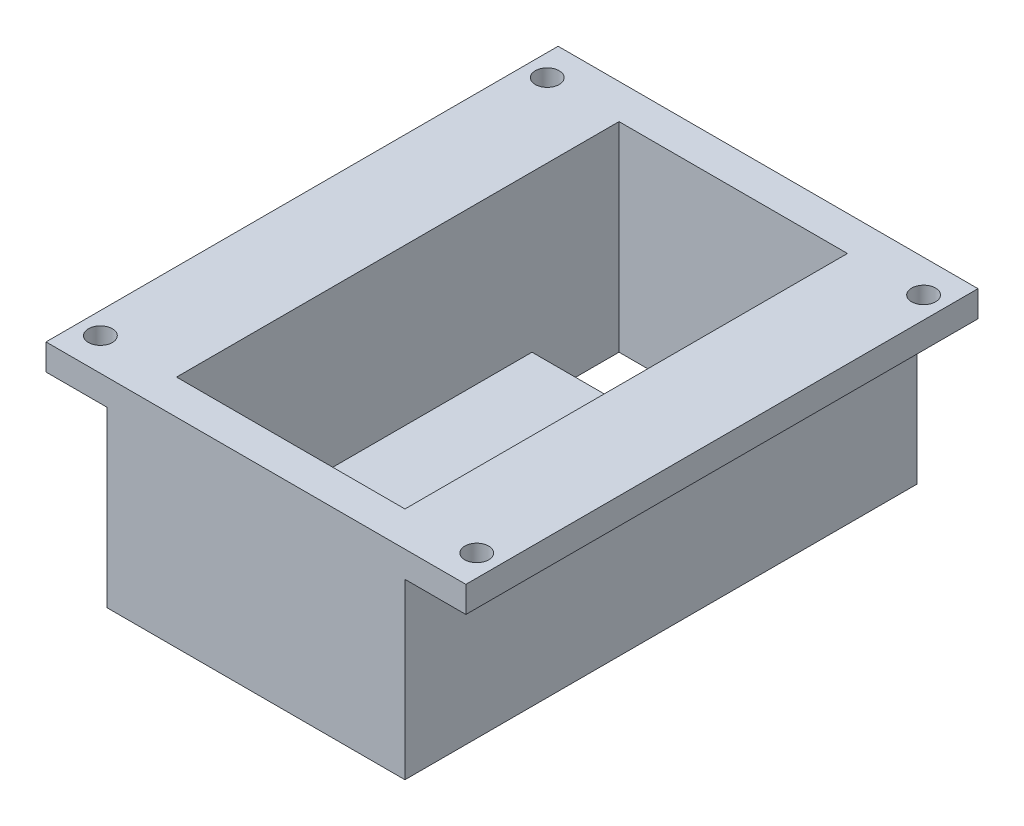
ISO-10303-21;
HEADER;
FILE_DESCRIPTION(('STEP AP214'),'2;1');
FILE_NAME('part.step','',(''),(''),'','','');
FILE_SCHEMA(('AUTOMOTIVE_DESIGN { 1 0 10303 214 1 1 1 1 }'));
ENDSEC;
DATA;
#1=APPLICATION_CONTEXT('core data for automotive mechanical design processes');
#2=APPLICATION_PROTOCOL_DEFINITION('international standard','automotive_design',2000,#1);
#3=PRODUCT_CONTEXT('',#1,'mechanical');
#4=PRODUCT('Part','Part','',(#3));
#5=PRODUCT_RELATED_PRODUCT_CATEGORY('part','',(#4));
#6=PRODUCT_DEFINITION_FORMATION('','',#4);
#7=PRODUCT_DEFINITION_CONTEXT('part definition',#1,'design');
#8=PRODUCT_DEFINITION('design','',#6,#7);
#9=PRODUCT_DEFINITION_SHAPE('','',#8);
#10=(LENGTH_UNIT() NAMED_UNIT(*) SI_UNIT(.MILLI.,.METRE.));
#11=(NAMED_UNIT(*) PLANE_ANGLE_UNIT() SI_UNIT($,.RADIAN.));
#12=(NAMED_UNIT(*) SI_UNIT($,.STERADIAN.) SOLID_ANGLE_UNIT());
#13=UNCERTAINTY_MEASURE_WITH_UNIT(LENGTH_MEASURE(1.E-05),#10,'distance_accuracy_value','');
#14=(GEOMETRIC_REPRESENTATION_CONTEXT(3) GLOBAL_UNCERTAINTY_ASSIGNED_CONTEXT((#13)) GLOBAL_UNIT_ASSIGNED_CONTEXT((#10,
#11,#12)) REPRESENTATION_CONTEXT('',''));
#15=CARTESIAN_POINT('',(0.,0.,0.));
#16=DIRECTION('',(0.,0.,1.));
#17=DIRECTION('',(1.,0.,0.));
#18=AXIS2_PLACEMENT_3D('',#15,#16,#17);
#19=CARTESIAN_POINT('',(9.8883841879781,38.0114144491201,67.8031633130832));
#20=DIRECTION('',(0.,1.,0.));
#21=DIRECTION('',(0.,0.,-1.));
#22=AXIS2_PLACEMENT_3D('',#19,#20,#21);
#23=PLANE('',#22);
#24=DIRECTION('',(-1.,0.,0.));
#25=VECTOR('',#24,1.);
#26=CARTESIAN_POINT('',(9.8883841879781,38.0114144491201,67.8031633130832));
#27=LINE('',#26,#25);
#28=CARTESIAN_POINT('',(36.1383841879781,38.0114144491201,67.8031633130832));
#29=VERTEX_POINT('',#28);
#30=CARTESIAN_POINT('',(9.8883841879781,38.0114144491201,67.8031633130832));
#31=VERTEX_POINT('',#30);
#32=EDGE_CURVE('E179',#29,#31,#27,.T.);
#33=ORIENTED_EDGE('',*,*,#32,.F.);
#34=DIRECTION('',(0.,0.,1.));
#35=VECTOR('',#34,1.);
#36=CARTESIAN_POINT('',(36.1383841879781,38.0114144491201,67.8031633130832));
#37=LINE('',#36,#35);
#38=CARTESIAN_POINT('',(36.1383841879781,38.0114144491201,26.9531633130832));
#39=VERTEX_POINT('',#38);
#40=EDGE_CURVE('E11',#39,#29,#37,.T.);
#41=ORIENTED_EDGE('',*,*,#40,.F.);
#42=DIRECTION('',(1.,0.,0.));
#43=VECTOR('',#42,1.);
#44=CARTESIAN_POINT('',(-1.11161581202189,38.0114144491201,26.9531633130832));
#45=LINE('',#44,#43);
#46=CARTESIAN_POINT('',(9.8883841879781,38.0114144491201,26.9531633130832));
#47=VERTEX_POINT('',#46);
#48=EDGE_CURVE('E202',#47,#39,#45,.T.);
#49=ORIENTED_EDGE('',*,*,#48,.F.);
#50=DIRECTION('',(0.,0.,-1.));
#51=VECTOR('',#50,1.);
#52=CARTESIAN_POINT('',(9.8883841879781,38.0114144491201,67.8031633130832));
#53=LINE('',#52,#51);
#54=EDGE_CURVE('E51',#31,#47,#53,.T.);
#55=ORIENTED_EDGE('',*,*,#54,.F.);
#56=EDGE_LOOP('',(#33,#41,#49,#55));
#57=FACE_BOUND('',#56,.T.);
#58=ADVANCED_FACE('F42',(#57),#23,.T.);
#59=CARTESIAN_POINT('',(47.1383841879781,33.0114144491201,71.8031633130832));
#60=DIRECTION('',(0.,1.,0.));
#61=DIRECTION('',(0.,0.,1.));
#62=AXIS2_PLACEMENT_3D('',#59,#60,#61);
#63=PLANE('',#62);
#64=DIRECTION('',(1.,0.,0.));
#65=VECTOR('',#64,1.);
#66=CARTESIAN_POINT('',(9.88838418797811,33.0114144491201,26.9531633130832));
#67=LINE('',#66,#65);
#68=CARTESIAN_POINT('',(9.88838418797811,33.0114144491201,26.9531633130832));
#69=VERTEX_POINT('',#68);
#70=CARTESIAN_POINT('',(36.1383841879781,33.0114144491201,26.9531633130832));
#71=VERTEX_POINT('',#70);
#72=EDGE_CURVE('E211',#69,#71,#67,.T.);
#73=ORIENTED_EDGE('',*,*,#72,.T.);
#74=DIRECTION('',(0.,0.,-1.));
#75=VECTOR('',#74,1.);
#76=CARTESIAN_POINT('',(36.1383841879781,33.0114144491201,16.9531633130832));
#77=LINE('',#76,#75);
#78=CARTESIAN_POINT('',(36.1383841879781,33.0114144491201,16.9531633130832));
#79=VERTEX_POINT('',#78);
#80=EDGE_CURVE('E222',#71,#79,#77,.T.);
#81=ORIENTED_EDGE('',*,*,#80,.T.);
#82=DIRECTION('',(-1.,0.,0.));
#83=VECTOR('',#82,1.);
#84=CARTESIAN_POINT('',(9.88838418797811,33.0114144491201,16.9531633130832));
#85=LINE('',#84,#83);
#86=CARTESIAN_POINT('',(9.88838418797811,33.0114144491201,16.9531633130832));
#87=VERTEX_POINT('',#86);
#88=EDGE_CURVE('E226',#79,#87,#85,.T.);
#89=ORIENTED_EDGE('',*,*,#88,.T.);
#90=DIRECTION('',(0.,0.,1.));
#91=VECTOR('',#90,1.);
#92=CARTESIAN_POINT('',(9.88838418797811,33.0114144491201,16.9531633130832));
#93=LINE('',#92,#91);
#94=EDGE_CURVE('E205',#87,#69,#93,.T.);
#95=ORIENTED_EDGE('',*,*,#94,.T.);
#96=EDGE_LOOP('',(#73,#81,#89,#95));
#97=FACE_BOUND('',#96,.T.);
#98=DIRECTION('',(-1.,0.,0.));
#99=VECTOR('',#98,1.);
#100=CARTESIAN_POINT('',(47.1383841879781,33.0114144491201,12.9531633130832));
#101=LINE('',#100,#99);
#102=CARTESIAN_POINT('',(40.1383841879781,33.0114144491201,12.9531633130832));
#103=VERTEX_POINT('',#102);
#104=CARTESIAN_POINT('',(5.8883841879781,33.0114144491201,12.9531633130832));
#105=VERTEX_POINT('',#104);
#106=EDGE_CURVE('E150',#103,#105,#101,.T.);
#107=ORIENTED_EDGE('',*,*,#106,.F.);
#108=DIRECTION('',(0.,0.,-1.));
#109=VECTOR('',#108,1.);
#110=CARTESIAN_POINT('',(40.1383841879781,33.0114144491201,71.8031633130832));
#111=LINE('',#110,#109);
#112=CARTESIAN_POINT('',(40.1383841879781,33.0114144491201,71.8031633130832));
#113=VERTEX_POINT('',#112);
#114=EDGE_CURVE('E159',#113,#103,#111,.T.);
#115=ORIENTED_EDGE('',*,*,#114,.F.);
#116=DIRECTION('',(1.,0.,0.));
#117=VECTOR('',#116,1.);
#118=CARTESIAN_POINT('',(47.1383841879781,33.0114144491201,71.8031633130832));
#119=LINE('',#118,#117);
#120=CARTESIAN_POINT('',(5.8883841879781,33.0114144491201,71.8031633130832));
#121=VERTEX_POINT('',#120);
#122=EDGE_CURVE('E173',#121,#113,#119,.T.);
#123=ORIENTED_EDGE('',*,*,#122,.F.);
#124=DIRECTION('',(0.,0.,1.));
#125=VECTOR('',#124,1.);
#126=CARTESIAN_POINT('',(5.8883841879781,33.0114144491201,12.9531633130832));
#127=LINE('',#126,#125);
#128=EDGE_CURVE('E167',#105,#121,#127,.T.);
#129=ORIENTED_EDGE('',*,*,#128,.F.);
#130=EDGE_LOOP('',(#107,#115,#123,#129));
#131=FACE_BOUND('',#130,.T.);
#132=ADVANCED_FACE('F170',(#97,#131),#63,.F.);
#133=CARTESIAN_POINT('',(47.1383841879781,35.0114144491201,12.9531633130832));
#134=DIRECTION('',(0.,0.,1.));
#135=DIRECTION('',(1.,0.,0.));
#136=AXIS2_PLACEMENT_3D('',#133,#134,#135);
#137=PLANE('',#136);
#138=DIRECTION('',(0.,-1.,0.));
#139=VECTOR('',#138,1.);
#140=CARTESIAN_POINT('',(40.1383841879781,55.9614144491201,12.9531633130832));
#141=LINE('',#140,#139);
#142=CARTESIAN_POINT('',(40.1383841879781,52.9614144491201,12.9531633130832));
#143=VERTEX_POINT('',#142);
#144=EDGE_CURVE('E146',#143,#103,#141,.T.);
#145=ORIENTED_EDGE('',*,*,#144,.T.);
#146=ORIENTED_EDGE('',*,*,#106,.T.);
#147=DIRECTION('',(0.,-1.,0.));
#148=VECTOR('',#147,1.);
#149=CARTESIAN_POINT('',(5.8883841879781,55.9614144491201,12.9531633130832));
#150=LINE('',#149,#148);
#151=CARTESIAN_POINT('',(5.8883841879781,52.9614144491201,12.9531633130832));
#152=VERTEX_POINT('',#151);
#153=EDGE_CURVE('E206',#152,#105,#150,.T.);
#154=ORIENTED_EDGE('',*,*,#153,.F.);
#155=DIRECTION('',(-1.,0.,0.));
#156=VECTOR('',#155,1.);
#157=CARTESIAN_POINT('',(5.8883841879781,52.9614144491201,12.9531633130832));
#158=LINE('',#157,#156);
#159=CARTESIAN_POINT('',(-1.1116158120219,52.9614144491201,12.9531633130832));
#160=VERTEX_POINT('',#159);
#161=EDGE_CURVE('E321',#152,#160,#158,.T.);
#162=ORIENTED_EDGE('',*,*,#161,.T.);
#163=DIRECTION('',(0.,1.,0.));
#164=VECTOR('',#163,1.);
#165=CARTESIAN_POINT('',(-1.1116158120219,52.9614144491201,12.9531633130832));
#166=LINE('',#165,#164);
#167=CARTESIAN_POINT('',(-1.1116158120219,55.9614144491201,12.9531633130832));
#168=VERTEX_POINT('',#167);
#169=EDGE_CURVE('E333',#160,#168,#166,.T.);
#170=ORIENTED_EDGE('',*,*,#169,.T.);
#171=DIRECTION('',(-1.,0.,0.));
#172=VECTOR('',#171,1.);
#173=CARTESIAN_POINT('',(40.1383841879781,55.9614144491201,12.9531633130832));
#174=LINE('',#173,#172);
#175=CARTESIAN_POINT('',(47.1383841879781,55.9614144491201,12.9531633130832));
#176=VERTEX_POINT('',#175);
#177=EDGE_CURVE('E267',#176,#168,#174,.T.);
#178=ORIENTED_EDGE('',*,*,#177,.F.);
#179=DIRECTION('',(0.,1.,0.));
#180=VECTOR('',#179,1.);
#181=CARTESIAN_POINT('',(47.1383841879781,52.9614144491201,12.9531633130832));
#182=LINE('',#181,#180);
#183=CARTESIAN_POINT('',(47.1383841879781,52.9614144491201,12.9531633130832));
#184=VERTEX_POINT('',#183);
#185=EDGE_CURVE('E309',#184,#176,#182,.T.);
#186=ORIENTED_EDGE('',*,*,#185,.F.);
#187=DIRECTION('',(-1.,0.,0.));
#188=VECTOR('',#187,1.);
#189=CARTESIAN_POINT('',(40.1383841879781,52.9614144491201,12.9531633130832));
#190=LINE('',#189,#188);
#191=EDGE_CURVE('E152',#184,#143,#190,.T.);
#192=ORIENTED_EDGE('',*,*,#191,.T.);
#193=EDGE_LOOP('',(#145,#146,#154,#162,#170,#178,#186,#192));
#194=FACE_BOUND('',#193,.T.);
#195=ADVANCED_FACE('F44',(#194),#137,.F.);
#196=CARTESIAN_POINT('',(47.1383841879781,35.0114144491201,71.8031633130832));
#197=DIRECTION('',(0.,0.,-1.));
#198=DIRECTION('',(-1.,0.,0.));
#199=AXIS2_PLACEMENT_3D('',#196,#197,#198);
#200=PLANE('',#199);
#201=ORIENTED_EDGE('',*,*,#122,.T.);
#202=DIRECTION('',(0.,-1.,0.));
#203=VECTOR('',#202,1.);
#204=CARTESIAN_POINT('',(40.1383841879781,55.9614144491201,71.8031633130832));
#205=LINE('',#204,#203);
#206=CARTESIAN_POINT('',(40.1383841879781,52.9614144491201,71.8031633130832));
#207=VERTEX_POINT('',#206);
#208=EDGE_CURVE('E155',#207,#113,#205,.T.);
#209=ORIENTED_EDGE('',*,*,#208,.F.);
#210=DIRECTION('',(1.,0.,0.));
#211=VECTOR('',#210,1.);
#212=CARTESIAN_POINT('',(40.1383841879781,52.9614144491201,71.8031633130832));
#213=LINE('',#212,#211);
#214=CARTESIAN_POINT('',(47.1383841879781,52.9614144491201,71.8031633130832));
#215=VERTEX_POINT('',#214);
#216=EDGE_CURVE('E304',#207,#215,#213,.T.);
#217=ORIENTED_EDGE('',*,*,#216,.T.);
#218=DIRECTION('',(0.,1.,0.));
#219=VECTOR('',#218,1.);
#220=CARTESIAN_POINT('',(47.1383841879781,52.9614144491201,71.8031633130832));
#221=LINE('',#220,#219);
#222=CARTESIAN_POINT('',(47.1383841879781,55.9614144491201,71.8031633130832));
#223=VERTEX_POINT('',#222);
#224=EDGE_CURVE('E314',#215,#223,#221,.T.);
#225=ORIENTED_EDGE('',*,*,#224,.T.);
#226=DIRECTION('',(1.,0.,0.));
#227=VECTOR('',#226,1.);
#228=CARTESIAN_POINT('',(5.8883841879781,55.9614144491201,71.8031633130832));
#229=LINE('',#228,#227);
#230=CARTESIAN_POINT('',(-1.1116158120219,55.9614144491201,71.8031633130832));
#231=VERTEX_POINT('',#230);
#232=EDGE_CURVE('E156',#231,#223,#229,.T.);
#233=ORIENTED_EDGE('',*,*,#232,.F.);
#234=DIRECTION('',(0.,1.,0.));
#235=VECTOR('',#234,1.);
#236=CARTESIAN_POINT('',(-1.1116158120219,52.9614144491201,71.8031633130832));
#237=LINE('',#236,#235);
#238=CARTESIAN_POINT('',(-1.1116158120219,52.9614144491201,71.8031633130832));
#239=VERTEX_POINT('',#238);
#240=EDGE_CURVE('E246',#239,#231,#237,.T.);
#241=ORIENTED_EDGE('',*,*,#240,.F.);
#242=DIRECTION('',(1.,0.,0.));
#243=VECTOR('',#242,1.);
#244=CARTESIAN_POINT('',(5.8883841879781,52.9614144491201,71.8031633130832));
#245=LINE('',#244,#243);
#246=CARTESIAN_POINT('',(5.8883841879781,52.9614144491201,71.8031633130832));
#247=VERTEX_POINT('',#246);
#248=EDGE_CURVE('E329',#239,#247,#245,.T.);
#249=ORIENTED_EDGE('',*,*,#248,.T.);
#250=DIRECTION('',(0.,-1.,0.));
#251=VECTOR('',#250,1.);
#252=CARTESIAN_POINT('',(5.8883841879781,55.9614144491201,71.8031633130832));
#253=LINE('',#252,#251);
#254=EDGE_CURVE('E213',#247,#121,#253,.T.);
#255=ORIENTED_EDGE('',*,*,#254,.T.);
#256=EDGE_LOOP('',(#201,#209,#217,#225,#233,#241,#249,#255));
#257=FACE_BOUND('',#256,.T.);
#258=ADVANCED_FACE('F349',(#257),#200,.F.);
#259=CARTESIAN_POINT('',(9.88838418797811,35.0114144491201,16.9531633130832));
#260=DIRECTION('',(1.,0.,0.));
#261=DIRECTION('',(0.,0.,-1.));
#262=AXIS2_PLACEMENT_3D('',#259,#260,#261);
#263=PLANE('',#262);
#264=DIRECTION('',(0.,-1.,0.));
#265=VECTOR('',#264,1.);
#266=CARTESIAN_POINT('',(9.8883841879781,55.9614144491201,67.8031633130832));
#267=LINE('',#266,#265);
#268=CARTESIAN_POINT('',(9.8883841879781,55.9614144491201,67.8031633130832));
#269=VERTEX_POINT('',#268);
#270=EDGE_CURVE('E197',#269,#31,#267,.T.);
#271=ORIENTED_EDGE('',*,*,#270,.T.);
#272=ORIENTED_EDGE('',*,*,#54,.T.);
#273=DIRECTION('',(0.,-1.,0.));
#274=VECTOR('',#273,1.);
#275=CARTESIAN_POINT('',(9.88838418797811,35.0114144491201,26.9531633130832));
#276=LINE('',#275,#274);
#277=EDGE_CURVE('E174',#47,#69,#276,.T.);
#278=ORIENTED_EDGE('',*,*,#277,.T.);
#279=ORIENTED_EDGE('',*,*,#94,.F.);
#280=DIRECTION('',(0.,-1.,0.));
#281=VECTOR('',#280,1.);
#282=CARTESIAN_POINT('',(9.88838418797811,35.0114144491201,16.9531633130832));
#283=LINE('',#282,#281);
#284=CARTESIAN_POINT('',(9.8883841879781,55.9614144491201,16.9531633130832));
#285=VERTEX_POINT('',#284);
#286=EDGE_CURVE('E58',#285,#87,#283,.T.);
#287=ORIENTED_EDGE('',*,*,#286,.F.);
#288=DIRECTION('',(0.,0.,1.));
#289=VECTOR('',#288,1.);
#290=CARTESIAN_POINT('',(9.8883841879781,55.9614144491201,16.9531633130832));
#291=LINE('',#290,#289);
#292=EDGE_CURVE('E239',#285,#269,#291,.T.);
#293=ORIENTED_EDGE('',*,*,#292,.T.);
#294=EDGE_LOOP('',(#271,#272,#278,#279,#287,#293));
#295=FACE_BOUND('',#294,.T.);
#296=ADVANCED_FACE('F194',(#295),#263,.T.);
#297=CARTESIAN_POINT('',(9.88838418797811,35.0114144491201,26.9531633130832));
#298=DIRECTION('',(0.,0.,-1.));
#299=DIRECTION('',(-1.,0.,0.));
#300=AXIS2_PLACEMENT_3D('',#297,#298,#299);
#301=PLANE('',#300);
#302=ORIENTED_EDGE('',*,*,#277,.F.);
#303=ORIENTED_EDGE('',*,*,#48,.T.);
#304=DIRECTION('',(0.,-1.,0.));
#305=VECTOR('',#304,1.);
#306=CARTESIAN_POINT('',(36.1383841879781,35.0114144491201,26.9531633130832));
#307=LINE('',#306,#305);
#308=EDGE_CURVE('E182',#39,#71,#307,.T.);
#309=ORIENTED_EDGE('',*,*,#308,.T.);
#310=ORIENTED_EDGE('',*,*,#72,.F.);
#311=EDGE_LOOP('',(#302,#303,#309,#310));
#312=FACE_BOUND('',#311,.T.);
#313=ADVANCED_FACE('F235',(#312),#301,.T.);
#314=CARTESIAN_POINT('',(36.1383841879781,35.0114144491201,16.9531633130832));
#315=DIRECTION('',(-1.,0.,0.));
#316=DIRECTION('',(0.,0.,1.));
#317=AXIS2_PLACEMENT_3D('',#314,#315,#316);
#318=PLANE('',#317);
#319=DIRECTION('',(0.,-1.,0.));
#320=VECTOR('',#319,1.);
#321=CARTESIAN_POINT('',(36.1383841879781,35.0114144491201,16.9531633130832));
#322=LINE('',#321,#320);
#323=CARTESIAN_POINT('',(36.1383841879781,55.9614144491201,16.9531633130832));
#324=VERTEX_POINT('',#323);
#325=EDGE_CURVE('E66',#324,#79,#322,.T.);
#326=ORIENTED_EDGE('',*,*,#325,.T.);
#327=ORIENTED_EDGE('',*,*,#80,.F.);
#328=ORIENTED_EDGE('',*,*,#308,.F.);
#329=ORIENTED_EDGE('',*,*,#40,.T.);
#330=DIRECTION('',(0.,-1.,0.));
#331=VECTOR('',#330,1.);
#332=CARTESIAN_POINT('',(36.1383841879781,55.9614144491201,67.8031633130832));
#333=LINE('',#332,#331);
#334=CARTESIAN_POINT('',(36.1383841879781,55.9614144491201,67.8031633130832));
#335=VERTEX_POINT('',#334);
#336=EDGE_CURVE('E262',#335,#29,#333,.T.);
#337=ORIENTED_EDGE('',*,*,#336,.F.);
#338=DIRECTION('',(0.,0.,-1.));
#339=VECTOR('',#338,1.);
#340=CARTESIAN_POINT('',(36.1383841879781,55.9614144491201,67.8031633130832));
#341=LINE('',#340,#339);
#342=EDGE_CURVE('E256',#335,#324,#341,.T.);
#343=ORIENTED_EDGE('',*,*,#342,.T.);
#344=EDGE_LOOP('',(#326,#327,#328,#329,#337,#343));
#345=FACE_BOUND('',#344,.T.);
#346=ADVANCED_FACE('F236',(#345),#318,.T.);
#347=CARTESIAN_POINT('',(9.88838418797811,35.0114144491201,16.9531633130832));
#348=DIRECTION('',(0.,0.,1.));
#349=DIRECTION('',(1.,0.,0.));
#350=AXIS2_PLACEMENT_3D('',#347,#348,#349);
#351=PLANE('',#350);
#352=ORIENTED_EDGE('',*,*,#88,.F.);
#353=ORIENTED_EDGE('',*,*,#325,.F.);
#354=DIRECTION('',(-1.,0.,0.));
#355=VECTOR('',#354,1.);
#356=CARTESIAN_POINT('',(36.1383841879781,55.9614144491201,16.9531633130832));
#357=LINE('',#356,#355);
#358=EDGE_CURVE('E241',#324,#285,#357,.T.);
#359=ORIENTED_EDGE('',*,*,#358,.T.);
#360=ORIENTED_EDGE('',*,*,#286,.T.);
#361=EDGE_LOOP('',(#352,#353,#359,#360));
#362=FACE_BOUND('',#361,.T.);
#363=ADVANCED_FACE('F242',(#362),#351,.T.);
#364=CARTESIAN_POINT('',(5.8883841879781,55.9614144491201,12.9531633130832));
#365=DIRECTION('',(1.,0.,0.));
#366=DIRECTION('',(0.,0.,-1.));
#367=AXIS2_PLACEMENT_3D('',#364,#365,#366);
#368=PLANE('',#367);
#369=ORIENTED_EDGE('',*,*,#153,.T.);
#370=ORIENTED_EDGE('',*,*,#128,.T.);
#371=ORIENTED_EDGE('',*,*,#254,.F.);
#372=DIRECTION('',(0.,0.,-1.));
#373=VECTOR('',#372,1.);
#374=CARTESIAN_POINT('',(5.8883841879781,52.9614144491201,71.8031633130832));
#375=LINE('',#374,#373);
#376=EDGE_CURVE('E318',#247,#152,#375,.T.);
#377=ORIENTED_EDGE('',*,*,#376,.T.);
#378=EDGE_LOOP('',(#369,#370,#371,#377));
#379=FACE_BOUND('',#378,.T.);
#380=ADVANCED_FACE('F386',(#379),#368,.F.);
#381=CARTESIAN_POINT('',(9.8883841879781,55.9614144491201,67.8031633130832));
#382=DIRECTION('',(0.,0.,-1.));
#383=DIRECTION('',(-1.,0.,0.));
#384=AXIS2_PLACEMENT_3D('',#381,#382,#383);
#385=PLANE('',#384);
#386=ORIENTED_EDGE('',*,*,#336,.T.);
#387=ORIENTED_EDGE('',*,*,#32,.T.);
#388=ORIENTED_EDGE('',*,*,#270,.F.);
#389=DIRECTION('',(1.,0.,0.));
#390=VECTOR('',#389,1.);
#391=CARTESIAN_POINT('',(9.8883841879781,55.9614144491201,67.8031633130832));
#392=LINE('',#391,#390);
#393=EDGE_CURVE('E251',#269,#335,#392,.T.);
#394=ORIENTED_EDGE('',*,*,#393,.T.);
#395=EDGE_LOOP('',(#386,#387,#388,#394));
#396=FACE_BOUND('',#395,.T.);
#397=ADVANCED_FACE('F462',(#396),#385,.T.);
#398=CARTESIAN_POINT('',(9.8883841879781,55.9614144491201,67.8031633130832));
#399=DIRECTION('',(0.,1.,0.));
#400=DIRECTION('',(0.,0.,1.));
#401=AXIS2_PLACEMENT_3D('',#398,#399,#400);
#402=PLANE('',#401);
#403=CARTESIAN_POINT('',(1.3883841879781,55.9614144491201,16.7031633130832));
#404=DIRECTION('',(0.,1.,0.));
#405=DIRECTION('',(0.,0.,-1.));
#406=AXIS2_PLACEMENT_3D('',#403,#404,#405);
#407=CIRCLE('',#406,1.375);
#408=CARTESIAN_POINT('',(1.3883841879781,55.9614144491201,15.3281633130832));
#409=VERTEX_POINT('',#408);
#410=EDGE_CURVE('E371',#409,#409,#407,.T.);
#411=ORIENTED_EDGE('',*,*,#410,.F.);
#412=EDGE_LOOP('',(#411));
#413=FACE_BOUND('',#412,.T.);
#414=CARTESIAN_POINT('',(44.6383841879781,55.9614144491201,68.0531633130832));
#415=DIRECTION('',(0.,1.,0.));
#416=DIRECTION('',(0.,0.,-1.));
#417=AXIS2_PLACEMENT_3D('',#414,#415,#416);
#418=CIRCLE('',#417,1.375);
#419=CARTESIAN_POINT('',(44.6383841879781,55.9614144491201,66.6781633130832));
#420=VERTEX_POINT('',#419);
#421=EDGE_CURVE('E372',#420,#420,#418,.T.);
#422=ORIENTED_EDGE('',*,*,#421,.F.);
#423=EDGE_LOOP('',(#422));
#424=FACE_BOUND('',#423,.T.);
#425=CARTESIAN_POINT('',(44.6383841879781,55.9614144491201,16.7031633130832));
#426=DIRECTION('',(0.,1.,0.));
#427=DIRECTION('',(0.,0.,1.));
#428=AXIS2_PLACEMENT_3D('',#425,#426,#427);
#429=CIRCLE('',#428,1.375);
#430=CARTESIAN_POINT('',(44.6383841879781,55.9614144491201,18.0781633130832));
#431=VERTEX_POINT('',#430);
#432=EDGE_CURVE('E166',#431,#431,#429,.T.);
#433=ORIENTED_EDGE('',*,*,#432,.F.);
#434=EDGE_LOOP('',(#433));
#435=FACE_BOUND('',#434,.T.);
#436=CARTESIAN_POINT('',(1.3883841879781,55.9614144491201,68.0531633130832));
#437=DIRECTION('',(0.,1.,0.));
#438=DIRECTION('',(0.,0.,1.));
#439=AXIS2_PLACEMENT_3D('',#436,#437,#438);
#440=CIRCLE('',#439,1.375);
#441=CARTESIAN_POINT('',(1.3883841879781,55.9614144491201,69.4281633130832));
#442=VERTEX_POINT('',#441);
#443=EDGE_CURVE('E281',#442,#442,#440,.T.);
#444=ORIENTED_EDGE('',*,*,#443,.F.);
#445=EDGE_LOOP('',(#444));
#446=FACE_BOUND('',#445,.T.);
#447=ORIENTED_EDGE('',*,*,#177,.T.);
#448=DIRECTION('',(0.,0.,1.));
#449=VECTOR('',#448,1.);
#450=CARTESIAN_POINT('',(-1.1116158120219,55.9614144491201,71.8031633130832));
#451=LINE('',#450,#449);
#452=EDGE_CURVE('E313',#168,#231,#451,.T.);
#453=ORIENTED_EDGE('',*,*,#452,.T.);
#454=ORIENTED_EDGE('',*,*,#232,.T.);
#455=DIRECTION('',(0.,0.,-1.));
#456=VECTOR('',#455,1.);
#457=CARTESIAN_POINT('',(47.1383841879781,55.9614144491201,71.8031633130832));
#458=LINE('',#457,#456);
#459=EDGE_CURVE('E292',#223,#176,#458,.T.);
#460=ORIENTED_EDGE('',*,*,#459,.T.);
#461=EDGE_LOOP('',(#447,#453,#454,#460));
#462=FACE_BOUND('',#461,.T.);
#463=ORIENTED_EDGE('',*,*,#292,.F.);
#464=ORIENTED_EDGE('',*,*,#358,.F.);
#465=ORIENTED_EDGE('',*,*,#342,.F.);
#466=ORIENTED_EDGE('',*,*,#393,.F.);
#467=EDGE_LOOP('',(#463,#464,#465,#466));
#468=FACE_BOUND('',#467,.T.);
#469=ADVANCED_FACE('F249',(#413,#424,#435,#446,#462,#468),#402,.T.);
#470=CARTESIAN_POINT('',(40.1383841879781,55.9614144491201,71.8031633130832));
#471=DIRECTION('',(-1.,0.,0.));
#472=DIRECTION('',(0.,0.,1.));
#473=AXIS2_PLACEMENT_3D('',#470,#471,#472);
#474=PLANE('',#473);
#475=DIRECTION('',(0.,0.,1.));
#476=VECTOR('',#475,1.);
#477=CARTESIAN_POINT('',(40.1383841879781,52.9614144491201,71.8031633130832));
#478=LINE('',#477,#476);
#479=EDGE_CURVE('E298',#143,#207,#478,.T.);
#480=ORIENTED_EDGE('',*,*,#479,.T.);
#481=ORIENTED_EDGE('',*,*,#208,.T.);
#482=ORIENTED_EDGE('',*,*,#114,.T.);
#483=ORIENTED_EDGE('',*,*,#144,.F.);
#484=EDGE_LOOP('',(#480,#481,#482,#483));
#485=FACE_BOUND('',#484,.T.);
#486=ADVANCED_FACE('F160',(#485),#474,.F.);
#487=CARTESIAN_POINT('',(-1.1116158120219,52.9614144491201,71.8031633130832));
#488=DIRECTION('',(-1.,0.,0.));
#489=DIRECTION('',(0.,0.,1.));
#490=AXIS2_PLACEMENT_3D('',#487,#488,#489);
#491=PLANE('',#490);
#492=ORIENTED_EDGE('',*,*,#452,.F.);
#493=ORIENTED_EDGE('',*,*,#169,.F.);
#494=DIRECTION('',(0.,0.,1.));
#495=VECTOR('',#494,1.);
#496=CARTESIAN_POINT('',(-1.1116158120219,52.9614144491201,71.8031633130832));
#497=LINE('',#496,#495);
#498=EDGE_CURVE('E325',#160,#239,#497,.T.);
#499=ORIENTED_EDGE('',*,*,#498,.T.);
#500=ORIENTED_EDGE('',*,*,#240,.T.);
#501=EDGE_LOOP('',(#492,#493,#499,#500));
#502=FACE_BOUND('',#501,.T.);
#503=ADVANCED_FACE('F346',(#502),#491,.T.);
#504=CARTESIAN_POINT('',(9.8883841879781,52.9614144491201,67.8031633130832));
#505=DIRECTION('',(0.,1.,0.));
#506=DIRECTION('',(0.,0.,1.));
#507=AXIS2_PLACEMENT_3D('',#504,#505,#506);
#508=PLANE('',#507);
#509=CARTESIAN_POINT('',(1.3883841879781,52.9614144491201,16.7031633130832));
#510=DIRECTION('',(0.,1.,0.));
#511=DIRECTION('',(0.,0.,1.));
#512=AXIS2_PLACEMENT_3D('',#509,#510,#511);
#513=CIRCLE('',#512,1.375);
#514=CARTESIAN_POINT('',(1.3883841879781,52.9614144491201,18.0781633130832));
#515=VERTEX_POINT('',#514);
#516=EDGE_CURVE('E216',#515,#515,#513,.T.);
#517=ORIENTED_EDGE('',*,*,#516,.T.);
#518=EDGE_LOOP('',(#517));
#519=FACE_BOUND('',#518,.T.);
#520=CARTESIAN_POINT('',(1.3883841879781,52.9614144491201,68.0531633130832));
#521=DIRECTION('',(0.,1.,0.));
#522=DIRECTION('',(0.,0.,1.));
#523=AXIS2_PLACEMENT_3D('',#520,#521,#522);
#524=CIRCLE('',#523,1.375);
#525=CARTESIAN_POINT('',(1.3883841879781,52.9614144491201,69.4281633130832));
#526=VERTEX_POINT('',#525);
#527=EDGE_CURVE('E284',#526,#526,#524,.T.);
#528=ORIENTED_EDGE('',*,*,#527,.T.);
#529=EDGE_LOOP('',(#528));
#530=FACE_BOUND('',#529,.T.);
#531=ORIENTED_EDGE('',*,*,#376,.F.);
#532=ORIENTED_EDGE('',*,*,#248,.F.);
#533=ORIENTED_EDGE('',*,*,#498,.F.);
#534=ORIENTED_EDGE('',*,*,#161,.F.);
#535=EDGE_LOOP('',(#531,#532,#533,#534));
#536=FACE_BOUND('',#535,.T.);
#537=ADVANCED_FACE('F389',(#519,#530,#536),#508,.F.);
#538=CARTESIAN_POINT('',(47.1383841879781,52.9614144491201,71.8031633130832));
#539=DIRECTION('',(1.,0.,0.));
#540=DIRECTION('',(0.,0.,-1.));
#541=AXIS2_PLACEMENT_3D('',#538,#539,#540);
#542=PLANE('',#541);
#543=ORIENTED_EDGE('',*,*,#459,.F.);
#544=ORIENTED_EDGE('',*,*,#224,.F.);
#545=DIRECTION('',(0.,0.,-1.));
#546=VECTOR('',#545,1.);
#547=CARTESIAN_POINT('',(47.1383841879781,52.9614144491201,71.8031633130832));
#548=LINE('',#547,#546);
#549=EDGE_CURVE('E355',#215,#184,#548,.T.);
#550=ORIENTED_EDGE('',*,*,#549,.T.);
#551=ORIENTED_EDGE('',*,*,#185,.T.);
#552=EDGE_LOOP('',(#543,#544,#550,#551));
#553=FACE_BOUND('',#552,.T.);
#554=ADVANCED_FACE('F354',(#553),#542,.T.);
#555=CARTESIAN_POINT('',(9.8883841879781,52.9614144491201,67.8031633130832));
#556=DIRECTION('',(0.,-1.,0.));
#557=DIRECTION('',(0.,0.,-1.));
#558=AXIS2_PLACEMENT_3D('',#555,#556,#557);
#559=PLANE('',#558);
#560=CARTESIAN_POINT('',(44.6383841879781,52.9614144491201,68.0531633130832));
#561=DIRECTION('',(0.,-1.,0.));
#562=DIRECTION('',(0.,0.,-1.));
#563=AXIS2_PLACEMENT_3D('',#560,#561,#562);
#564=CIRCLE('',#563,1.375);
#565=CARTESIAN_POINT('',(44.6383841879781,52.9614144491201,66.6781633130832));
#566=VERTEX_POINT('',#565);
#567=EDGE_CURVE('E280',#566,#566,#564,.T.);
#568=ORIENTED_EDGE('',*,*,#567,.F.);
#569=EDGE_LOOP('',(#568));
#570=FACE_BOUND('',#569,.T.);
#571=CARTESIAN_POINT('',(44.6383841879781,52.9614144491201,16.7031633130832));
#572=DIRECTION('',(0.,-1.,0.));
#573=DIRECTION('',(0.,0.,-1.));
#574=AXIS2_PLACEMENT_3D('',#571,#572,#573);
#575=CIRCLE('',#574,1.375);
#576=CARTESIAN_POINT('',(44.6383841879781,52.9614144491201,15.3281633130832));
#577=VERTEX_POINT('',#576);
#578=EDGE_CURVE('E276',#577,#577,#575,.T.);
#579=ORIENTED_EDGE('',*,*,#578,.F.);
#580=EDGE_LOOP('',(#579));
#581=FACE_BOUND('',#580,.T.);
#582=ORIENTED_EDGE('',*,*,#479,.F.);
#583=ORIENTED_EDGE('',*,*,#191,.F.);
#584=ORIENTED_EDGE('',*,*,#549,.F.);
#585=ORIENTED_EDGE('',*,*,#216,.F.);
#586=EDGE_LOOP('',(#582,#583,#584,#585));
#587=FACE_BOUND('',#586,.T.);
#588=ADVANCED_FACE('F358',(#570,#581,#587),#559,.T.);
#589=CARTESIAN_POINT('',(44.6383841879781,35.0114144491201,16.7031633130832));
#590=DIRECTION('',(0.,1.,0.));
#591=DIRECTION('',(0.,0.,1.));
#592=AXIS2_PLACEMENT_3D('',#589,#590,#591);
#593=CYLINDRICAL_SURFACE('',#592,1.375);
#594=ORIENTED_EDGE('',*,*,#578,.T.);
#595=EDGE_LOOP('',(#594));
#596=FACE_BOUND('',#595,.T.);
#597=ORIENTED_EDGE('',*,*,#432,.T.);
#598=EDGE_LOOP('',(#597));
#599=FACE_BOUND('',#598,.T.);
#600=ADVANCED_FACE('F491',(#596,#599),#593,.F.);
#601=CARTESIAN_POINT('',(44.6383841879781,35.0114144491201,68.0531633130832));
#602=DIRECTION('',(0.,1.,0.));
#603=DIRECTION('',(0.,0.,1.));
#604=AXIS2_PLACEMENT_3D('',#601,#602,#603);
#605=CYLINDRICAL_SURFACE('',#604,1.375);
#606=ORIENTED_EDGE('',*,*,#567,.T.);
#607=EDGE_LOOP('',(#606));
#608=FACE_BOUND('',#607,.T.);
#609=ORIENTED_EDGE('',*,*,#421,.T.);
#610=EDGE_LOOP('',(#609));
#611=FACE_BOUND('',#610,.T.);
#612=ADVANCED_FACE('F506',(#608,#611),#605,.F.);
#613=CARTESIAN_POINT('',(1.3883841879781,35.0114144491201,68.0531633130832));
#614=DIRECTION('',(0.,1.,0.));
#615=DIRECTION('',(0.,0.,1.));
#616=AXIS2_PLACEMENT_3D('',#613,#614,#615);
#617=CYLINDRICAL_SURFACE('',#616,1.375);
#618=ORIENTED_EDGE('',*,*,#443,.T.);
#619=EDGE_LOOP('',(#618));
#620=FACE_BOUND('',#619,.T.);
#621=ORIENTED_EDGE('',*,*,#527,.F.);
#622=EDGE_LOOP('',(#621));
#623=FACE_BOUND('',#622,.T.);
#624=ADVANCED_FACE('F515',(#620,#623),#617,.F.);
#625=CARTESIAN_POINT('',(1.3883841879781,35.0114144491201,16.7031633130832));
#626=DIRECTION('',(0.,1.,0.));
#627=DIRECTION('',(0.,0.,1.));
#628=AXIS2_PLACEMENT_3D('',#625,#626,#627);
#629=CYLINDRICAL_SURFACE('',#628,1.375);
#630=ORIENTED_EDGE('',*,*,#410,.T.);
#631=EDGE_LOOP('',(#630));
#632=FACE_BOUND('',#631,.T.);
#633=ORIENTED_EDGE('',*,*,#516,.F.);
#634=EDGE_LOOP('',(#633));
#635=FACE_BOUND('',#634,.T.);
#636=ADVANCED_FACE('F525',(#632,#635),#629,.F.);
#637=CLOSED_SHELL('',(#58,#132,#195,#258,#296,#313,#346,#363,#380,#397,#469,#486,#503,#537,#554,
#588,#600,#612,#624,#636));
#638=MANIFOLD_SOLID_BREP('B2',#637);
#639=ADVANCED_BREP_SHAPE_REPRESENTATION('',(#18,#638),#14);
#640=SHAPE_DEFINITION_REPRESENTATION(#9,#639);
ENDSEC;
END-ISO-10303-21;
